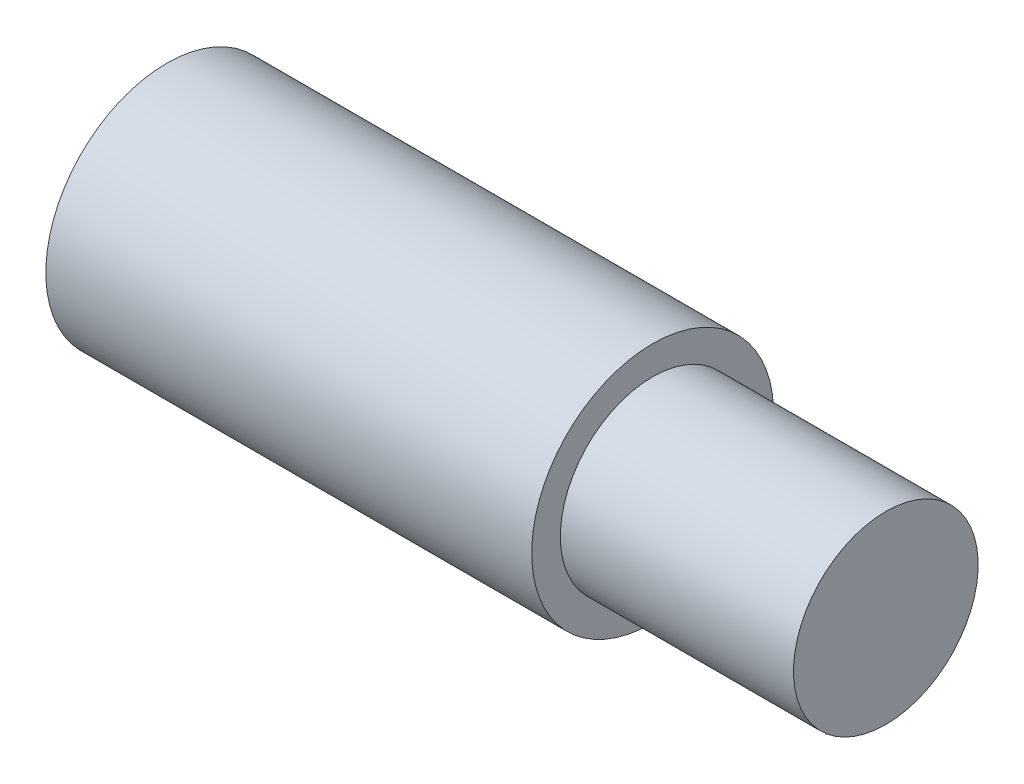
ISO-10303-21;
HEADER;
FILE_DESCRIPTION(('STEP AP214'),'2;1');
FILE_NAME('part.step','',(''),(''),'','','');
FILE_SCHEMA(('AUTOMOTIVE_DESIGN { 1 0 10303 214 1 1 1 1 }'));
ENDSEC;
DATA;
#1=APPLICATION_CONTEXT('core data for automotive mechanical design processes');
#2=APPLICATION_PROTOCOL_DEFINITION('international standard','automotive_design',2000,#1);
#3=PRODUCT_CONTEXT('',#1,'mechanical');
#4=PRODUCT('Part','Part','',(#3));
#5=PRODUCT_RELATED_PRODUCT_CATEGORY('part','',(#4));
#6=PRODUCT_DEFINITION_FORMATION('','',#4);
#7=PRODUCT_DEFINITION_CONTEXT('part definition',#1,'design');
#8=PRODUCT_DEFINITION('design','',#6,#7);
#9=PRODUCT_DEFINITION_SHAPE('','',#8);
#10=(LENGTH_UNIT() NAMED_UNIT(*) SI_UNIT(.MILLI.,.METRE.));
#11=(NAMED_UNIT(*) PLANE_ANGLE_UNIT() SI_UNIT($,.RADIAN.));
#12=(NAMED_UNIT(*) SI_UNIT($,.STERADIAN.) SOLID_ANGLE_UNIT());
#13=UNCERTAINTY_MEASURE_WITH_UNIT(LENGTH_MEASURE(1.E-05),#10,'distance_accuracy_value','');
#14=(GEOMETRIC_REPRESENTATION_CONTEXT(3) GLOBAL_UNCERTAINTY_ASSIGNED_CONTEXT((#13)) GLOBAL_UNIT_ASSIGNED_CONTEXT((#10,
#11,#12)) REPRESENTATION_CONTEXT('',''));
#15=CARTESIAN_POINT('',(0.,0.,0.));
#16=DIRECTION('',(0.,0.,1.));
#17=DIRECTION('',(1.,0.,0.));
#18=AXIS2_PLACEMENT_3D('',#15,#16,#17);
#19=CARTESIAN_POINT('',(0.,0.,0.));
#20=DIRECTION('',(1.,0.,0.));
#21=DIRECTION('',(0.,1.,0.));
#22=AXIS2_PLACEMENT_3D('',#19,#20,#21);
#23=PLANE('',#22);
#24=CARTESIAN_POINT('',(0.,0.,0.));
#25=DIRECTION('',(-1.,0.,0.));
#26=DIRECTION('',(0.,-1.,0.));
#27=AXIS2_PLACEMENT_3D('',#24,#25,#26);
#28=CIRCLE('',#27,3.1623);
#29=CARTESIAN_POINT('',(0.,-3.1623,0.));
#30=VERTEX_POINT('',#29);
#31=EDGE_CURVE('E10',#30,#30,#28,.T.);
#32=ORIENTED_EDGE('',*,*,#31,.T.);
#33=EDGE_LOOP('',(#32));
#34=FACE_BOUND('',#33,.T.);
#35=ADVANCED_FACE('F41',(#34),#23,.F.);
#36=CARTESIAN_POINT('',(0.,0.,0.));
#37=DIRECTION('',(-1.,0.,0.));
#38=DIRECTION('',(0.,-1.,0.));
#39=AXIS2_PLACEMENT_3D('',#36,#37,#38);
#40=CYLINDRICAL_SURFACE('',#39,3.1623);
#41=ORIENTED_EDGE('',*,*,#31,.F.);
#42=EDGE_LOOP('',(#41));
#43=FACE_BOUND('',#42,.T.);
#44=CARTESIAN_POINT('',(12.7,0.,0.));
#45=DIRECTION('',(-1.,0.,0.));
#46=DIRECTION('',(0.,-1.,0.));
#47=AXIS2_PLACEMENT_3D('',#44,#45,#46);
#48=CIRCLE('',#47,3.1623);
#49=CARTESIAN_POINT('',(12.7,-3.1623,0.));
#50=VERTEX_POINT('',#49);
#51=EDGE_CURVE('E48',#50,#50,#48,.T.);
#52=ORIENTED_EDGE('',*,*,#51,.T.);
#53=EDGE_LOOP('',(#52));
#54=FACE_BOUND('',#53,.T.);
#55=ADVANCED_FACE('F77',(#43,#54),#40,.T.);
#56=CARTESIAN_POINT('',(12.7,3.1623,0.));
#57=DIRECTION('',(-1.,0.,0.));
#58=DIRECTION('',(0.,-1.,0.));
#59=AXIS2_PLACEMENT_3D('',#56,#57,#58);
#60=PLANE('',#59);
#61=ORIENTED_EDGE('',*,*,#51,.F.);
#62=EDGE_LOOP('',(#61));
#63=FACE_BOUND('',#62,.T.);
#64=CARTESIAN_POINT('',(12.7,0.,0.));
#65=DIRECTION('',(-1.,0.,0.));
#66=DIRECTION('',(0.,-1.,0.));
#67=AXIS2_PLACEMENT_3D('',#64,#65,#66);
#68=CIRCLE('',#67,2.413);
#69=CARTESIAN_POINT('',(12.7,-2.413,0.));
#70=VERTEX_POINT('',#69);
#71=EDGE_CURVE('E53',#70,#70,#68,.T.);
#72=ORIENTED_EDGE('',*,*,#71,.T.);
#73=EDGE_LOOP('',(#72));
#74=FACE_BOUND('',#73,.T.);
#75=ADVANCED_FACE('F73',(#63,#74),#60,.F.);
#76=CARTESIAN_POINT('',(0.,0.,0.));
#77=DIRECTION('',(-1.,0.,0.));
#78=DIRECTION('',(0.,-1.,0.));
#79=AXIS2_PLACEMENT_3D('',#76,#77,#78);
#80=CYLINDRICAL_SURFACE('',#79,2.413);
#81=ORIENTED_EDGE('',*,*,#71,.F.);
#82=EDGE_LOOP('',(#81));
#83=FACE_BOUND('',#82,.T.);
#84=CARTESIAN_POINT('',(18.796,0.,0.));
#85=DIRECTION('',(-1.,0.,0.));
#86=DIRECTION('',(0.,-1.,0.));
#87=AXIS2_PLACEMENT_3D('',#84,#85,#86);
#88=CIRCLE('',#87,2.413);
#89=CARTESIAN_POINT('',(18.796,-2.413,0.));
#90=VERTEX_POINT('',#89);
#91=EDGE_CURVE('E58',#90,#90,#88,.T.);
#92=ORIENTED_EDGE('',*,*,#91,.T.);
#93=EDGE_LOOP('',(#92));
#94=FACE_BOUND('',#93,.T.);
#95=ADVANCED_FACE('F65',(#83,#94),#80,.T.);
#96=CARTESIAN_POINT('',(18.796,2.413,0.));
#97=DIRECTION('',(-1.,0.,0.));
#98=DIRECTION('',(0.,-1.,0.));
#99=AXIS2_PLACEMENT_3D('',#96,#97,#98);
#100=PLANE('',#99);
#101=ORIENTED_EDGE('',*,*,#91,.F.);
#102=EDGE_LOOP('',(#101));
#103=FACE_BOUND('',#102,.T.);
#104=ADVANCED_FACE('F67',(#103),#100,.F.);
#105=CLOSED_SHELL('',(#35,#55,#75,#95,#104));
#106=MANIFOLD_SOLID_BREP('B2',#105);
#107=ADVANCED_BREP_SHAPE_REPRESENTATION('',(#18,#106),#14);
#108=SHAPE_DEFINITION_REPRESENTATION(#9,#107);
ENDSEC;
END-ISO-10303-21;
